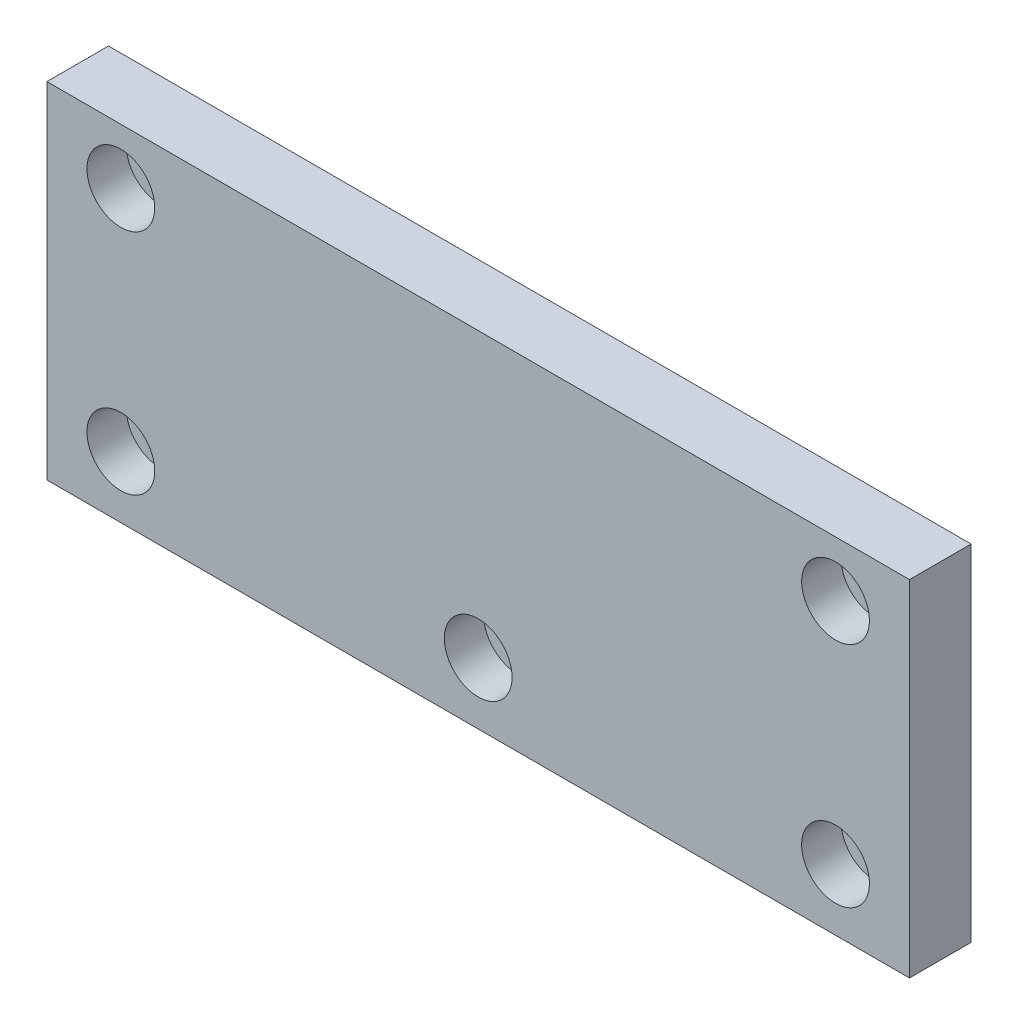
ISO-10303-21;
HEADER;
FILE_DESCRIPTION(('STEP AP214'),'2;1');
FILE_NAME('part.step','',(''),(''),'','','');
FILE_SCHEMA(('AUTOMOTIVE_DESIGN { 1 0 10303 214 1 1 1 1 }'));
ENDSEC;
DATA;
#1=APPLICATION_CONTEXT('core data for automotive mechanical design processes');
#2=APPLICATION_PROTOCOL_DEFINITION('international standard','automotive_design',2000,#1);
#3=PRODUCT_CONTEXT('',#1,'mechanical');
#4=PRODUCT('Part','Part','',(#3));
#5=PRODUCT_RELATED_PRODUCT_CATEGORY('part','',(#4));
#6=PRODUCT_DEFINITION_FORMATION('','',#4);
#7=PRODUCT_DEFINITION_CONTEXT('part definition',#1,'design');
#8=PRODUCT_DEFINITION('design','',#6,#7);
#9=PRODUCT_DEFINITION_SHAPE('','',#8);
#10=(LENGTH_UNIT() NAMED_UNIT(*) SI_UNIT(.MILLI.,.METRE.));
#11=(NAMED_UNIT(*) PLANE_ANGLE_UNIT() SI_UNIT($,.RADIAN.));
#12=(NAMED_UNIT(*) SI_UNIT($,.STERADIAN.) SOLID_ANGLE_UNIT());
#13=UNCERTAINTY_MEASURE_WITH_UNIT(LENGTH_MEASURE(1.E-05),#10,'distance_accuracy_value','');
#14=(GEOMETRIC_REPRESENTATION_CONTEXT(3) GLOBAL_UNCERTAINTY_ASSIGNED_CONTEXT((#13)) GLOBAL_UNIT_ASSIGNED_CONTEXT((#10,
#11,#12)) REPRESENTATION_CONTEXT('',''));
#15=CARTESIAN_POINT('',(0.,0.,0.));
#16=DIRECTION('',(0.,0.,1.));
#17=DIRECTION('',(1.,0.,0.));
#18=AXIS2_PLACEMENT_3D('',#15,#16,#17);
#19=CARTESIAN_POINT('',(70.,28.,10.));
#20=DIRECTION('',(-1.,0.,0.));
#21=DIRECTION('',(0.,-1.,0.));
#22=AXIS2_PLACEMENT_3D('',#19,#20,#21);
#23=PLANE('',#22);
#24=DIRECTION('',(0.,1.,0.));
#25=VECTOR('',#24,1.);
#26=CARTESIAN_POINT('',(70.,28.,0.));
#27=LINE('',#26,#25);
#28=CARTESIAN_POINT('',(70.,-28.,0.));
#29=VERTEX_POINT('',#28);
#30=CARTESIAN_POINT('',(70.,28.,0.));
#31=VERTEX_POINT('',#30);
#32=EDGE_CURVE('E100',#29,#31,#27,.T.);
#33=ORIENTED_EDGE('',*,*,#32,.T.);
#34=DIRECTION('',(0.,0.,-1.));
#35=VECTOR('',#34,1.);
#36=CARTESIAN_POINT('',(70.,28.,10.));
#37=LINE('',#36,#35);
#38=CARTESIAN_POINT('',(70.,28.,10.));
#39=VERTEX_POINT('',#38);
#40=EDGE_CURVE('E11',#39,#31,#37,.T.);
#41=ORIENTED_EDGE('',*,*,#40,.F.);
#42=DIRECTION('',(0.,1.,0.));
#43=VECTOR('',#42,1.);
#44=CARTESIAN_POINT('',(70.,28.,10.));
#45=LINE('',#44,#43);
#46=CARTESIAN_POINT('',(70.,-28.,10.));
#47=VERTEX_POINT('',#46);
#48=EDGE_CURVE('E88',#47,#39,#45,.T.);
#49=ORIENTED_EDGE('',*,*,#48,.F.);
#50=DIRECTION('',(0.,0.,-1.));
#51=VECTOR('',#50,1.);
#52=CARTESIAN_POINT('',(70.,-28.,10.));
#53=LINE('',#52,#51);
#54=EDGE_CURVE('E96',#47,#29,#53,.T.);
#55=ORIENTED_EDGE('',*,*,#54,.T.);
#56=EDGE_LOOP('',(#33,#41,#49,#55));
#57=FACE_BOUND('',#56,.T.);
#58=ADVANCED_FACE('F37',(#57),#23,.F.);
#59=CARTESIAN_POINT('',(-70.,28.,10.));
#60=DIRECTION('',(0.,-1.,0.));
#61=DIRECTION('',(1.,0.,0.));
#62=AXIS2_PLACEMENT_3D('',#59,#60,#61);
#63=PLANE('',#62);
#64=DIRECTION('',(-1.,0.,0.));
#65=VECTOR('',#64,1.);
#66=CARTESIAN_POINT('',(-70.,28.,0.));
#67=LINE('',#66,#65);
#68=CARTESIAN_POINT('',(-70.,28.,0.));
#69=VERTEX_POINT('',#68);
#70=EDGE_CURVE('E92',#31,#69,#67,.T.);
#71=ORIENTED_EDGE('',*,*,#70,.T.);
#72=DIRECTION('',(0.,0.,-1.));
#73=VECTOR('',#72,1.);
#74=CARTESIAN_POINT('',(-70.,28.,10.));
#75=LINE('',#74,#73);
#76=CARTESIAN_POINT('',(-70.,28.,10.));
#77=VERTEX_POINT('',#76);
#78=EDGE_CURVE('E45',#77,#69,#75,.T.);
#79=ORIENTED_EDGE('',*,*,#78,.F.);
#80=DIRECTION('',(-1.,0.,0.));
#81=VECTOR('',#80,1.);
#82=CARTESIAN_POINT('',(-70.,28.,10.));
#83=LINE('',#82,#81);
#84=EDGE_CURVE('E83',#39,#77,#83,.T.);
#85=ORIENTED_EDGE('',*,*,#84,.F.);
#86=ORIENTED_EDGE('',*,*,#40,.T.);
#87=EDGE_LOOP('',(#71,#79,#85,#86));
#88=FACE_BOUND('',#87,.T.);
#89=ADVANCED_FACE('F91',(#88),#63,.F.);
#90=CARTESIAN_POINT('',(-70.,28.,10.));
#91=DIRECTION('',(1.,0.,0.));
#92=DIRECTION('',(0.,1.,0.));
#93=AXIS2_PLACEMENT_3D('',#90,#91,#92);
#94=PLANE('',#93);
#95=DIRECTION('',(0.,-1.,0.));
#96=VECTOR('',#95,1.);
#97=CARTESIAN_POINT('',(-70.,28.,0.));
#98=LINE('',#97,#96);
#99=CARTESIAN_POINT('',(-70.,-28.,0.));
#100=VERTEX_POINT('',#99);
#101=EDGE_CURVE('E70',#69,#100,#98,.T.);
#102=ORIENTED_EDGE('',*,*,#101,.T.);
#103=DIRECTION('',(0.,0.,-1.));
#104=VECTOR('',#103,1.);
#105=CARTESIAN_POINT('',(-70.,-28.,10.));
#106=LINE('',#105,#104);
#107=CARTESIAN_POINT('',(-70.,-28.,10.));
#108=VERTEX_POINT('',#107);
#109=EDGE_CURVE('E93',#108,#100,#106,.T.);
#110=ORIENTED_EDGE('',*,*,#109,.F.);
#111=DIRECTION('',(0.,-1.,0.));
#112=VECTOR('',#111,1.);
#113=CARTESIAN_POINT('',(-70.,28.,10.));
#114=LINE('',#113,#112);
#115=EDGE_CURVE('E86',#77,#108,#114,.T.);
#116=ORIENTED_EDGE('',*,*,#115,.F.);
#117=ORIENTED_EDGE('',*,*,#78,.T.);
#118=EDGE_LOOP('',(#102,#110,#116,#117));
#119=FACE_BOUND('',#118,.T.);
#120=ADVANCED_FACE('F94',(#119),#94,.F.);
#121=CARTESIAN_POINT('',(-70.,-28.,10.));
#122=DIRECTION('',(0.,1.,0.));
#123=DIRECTION('',(-1.,0.,0.));
#124=AXIS2_PLACEMENT_3D('',#121,#122,#123);
#125=PLANE('',#124);
#126=DIRECTION('',(1.,0.,0.));
#127=VECTOR('',#126,1.);
#128=CARTESIAN_POINT('',(-70.,-28.,0.));
#129=LINE('',#128,#127);
#130=EDGE_CURVE('E76',#100,#29,#129,.T.);
#131=ORIENTED_EDGE('',*,*,#130,.T.);
#132=ORIENTED_EDGE('',*,*,#54,.F.);
#133=DIRECTION('',(1.,0.,0.));
#134=VECTOR('',#133,1.);
#135=CARTESIAN_POINT('',(-70.,-28.,10.));
#136=LINE('',#135,#134);
#137=EDGE_CURVE('E53',#108,#47,#136,.T.);
#138=ORIENTED_EDGE('',*,*,#137,.F.);
#139=ORIENTED_EDGE('',*,*,#109,.T.);
#140=EDGE_LOOP('',(#131,#132,#138,#139));
#141=FACE_BOUND('',#140,.T.);
#142=ADVANCED_FACE('F108',(#141),#125,.F.);
#143=CARTESIAN_POINT('',(0.,0.,10.));
#144=DIRECTION('',(0.,0.,1.));
#145=DIRECTION('',(1.,0.,0.));
#146=AXIS2_PLACEMENT_3D('',#143,#144,#145);
#147=PLANE('',#146);
#148=CARTESIAN_POINT('',(58.0000000000009,-17.9999999999985,10.));
#149=DIRECTION('',(0.,0.,1.));
#150=DIRECTION('',(1.,0.,0.));
#151=AXIS2_PLACEMENT_3D('',#148,#149,#150);
#152=CIRCLE('',#151,5.49999999999999);
#153=CARTESIAN_POINT('',(63.5000000000009,-17.9999999999985,10.));
#154=VERTEX_POINT('',#153);
#155=EDGE_CURVE('E170',#154,#154,#152,.T.);
#156=ORIENTED_EDGE('',*,*,#155,.F.);
#157=EDGE_LOOP('',(#156));
#158=FACE_BOUND('',#157,.T.);
#159=CARTESIAN_POINT('',(58.0000000000009,19.0000000000015,10.));
#160=DIRECTION('',(0.,0.,1.));
#161=DIRECTION('',(1.,0.,0.));
#162=AXIS2_PLACEMENT_3D('',#159,#160,#161);
#163=CIRCLE('',#162,5.49999999999999);
#164=CARTESIAN_POINT('',(63.5000000000009,19.0000000000015,10.));
#165=VERTEX_POINT('',#164);
#166=EDGE_CURVE('E158',#165,#165,#163,.T.);
#167=ORIENTED_EDGE('',*,*,#166,.F.);
#168=EDGE_LOOP('',(#167));
#169=FACE_BOUND('',#168,.T.);
#170=CARTESIAN_POINT('',(8.88178419700125E-13,-17.9999999999985,10.));
#171=DIRECTION('',(0.,0.,1.));
#172=DIRECTION('',(1.,0.,0.));
#173=AXIS2_PLACEMENT_3D('',#170,#171,#172);
#174=CIRCLE('',#173,5.49999999999999);
#175=CARTESIAN_POINT('',(5.50000000000088,-17.9999999999985,10.));
#176=VERTEX_POINT('',#175);
#177=EDGE_CURVE('E146',#176,#176,#174,.T.);
#178=ORIENTED_EDGE('',*,*,#177,.F.);
#179=EDGE_LOOP('',(#178));
#180=FACE_BOUND('',#179,.T.);
#181=CARTESIAN_POINT('',(-57.9999999999991,-17.9999999999985,10.));
#182=DIRECTION('',(0.,0.,1.));
#183=DIRECTION('',(1.,0.,0.));
#184=AXIS2_PLACEMENT_3D('',#181,#182,#183);
#185=CIRCLE('',#184,5.49999999999999);
#186=CARTESIAN_POINT('',(-52.4999999999991,-17.9999999999985,10.));
#187=VERTEX_POINT('',#186);
#188=EDGE_CURVE('E134',#187,#187,#185,.T.);
#189=ORIENTED_EDGE('',*,*,#188,.F.);
#190=EDGE_LOOP('',(#189));
#191=FACE_BOUND('',#190,.T.);
#192=CARTESIAN_POINT('',(-57.9999999999991,19.0000000000015,10.));
#193=DIRECTION('',(0.,0.,1.));
#194=DIRECTION('',(1.,0.,0.));
#195=AXIS2_PLACEMENT_3D('',#192,#193,#194);
#196=CIRCLE('',#195,5.49999999999999);
#197=CARTESIAN_POINT('',(-52.4999999999991,19.0000000000015,10.));
#198=VERTEX_POINT('',#197);
#199=EDGE_CURVE('E122',#198,#198,#196,.T.);
#200=ORIENTED_EDGE('',*,*,#199,.F.);
#201=EDGE_LOOP('',(#200));
#202=FACE_BOUND('',#201,.T.);
#203=ORIENTED_EDGE('',*,*,#48,.T.);
#204=ORIENTED_EDGE('',*,*,#84,.T.);
#205=ORIENTED_EDGE('',*,*,#115,.T.);
#206=ORIENTED_EDGE('',*,*,#137,.T.);
#207=EDGE_LOOP('',(#203,#204,#205,#206));
#208=FACE_BOUND('',#207,.T.);
#209=ADVANCED_FACE('F84',(#158,#169,#180,#191,#202,#208),#147,.T.);
#210=CARTESIAN_POINT('',(0.,0.,0.));
#211=DIRECTION('',(0.,0.,1.));
#212=DIRECTION('',(1.,0.,0.));
#213=AXIS2_PLACEMENT_3D('',#210,#211,#212);
#214=PLANE('',#213);
#215=CARTESIAN_POINT('',(58.0000000000009,-17.9999999999985,0.));
#216=DIRECTION('',(0.,0.,1.));
#217=DIRECTION('',(1.,0.,0.));
#218=AXIS2_PLACEMENT_3D('',#215,#216,#217);
#219=CIRCLE('',#218,3.3);
#220=CARTESIAN_POINT('',(61.3000000000009,-17.9999999999985,0.));
#221=VERTEX_POINT('',#220);
#222=EDGE_CURVE('E161',#221,#221,#219,.T.);
#223=ORIENTED_EDGE('',*,*,#222,.T.);
#224=EDGE_LOOP('',(#223));
#225=FACE_BOUND('',#224,.T.);
#226=CARTESIAN_POINT('',(58.0000000000009,19.0000000000015,0.));
#227=DIRECTION('',(0.,0.,1.));
#228=DIRECTION('',(1.,0.,0.));
#229=AXIS2_PLACEMENT_3D('',#226,#227,#228);
#230=CIRCLE('',#229,3.3);
#231=CARTESIAN_POINT('',(61.3000000000009,19.0000000000015,0.));
#232=VERTEX_POINT('',#231);
#233=EDGE_CURVE('E149',#232,#232,#230,.T.);
#234=ORIENTED_EDGE('',*,*,#233,.T.);
#235=EDGE_LOOP('',(#234));
#236=FACE_BOUND('',#235,.T.);
#237=CARTESIAN_POINT('',(8.88178419700125E-13,-17.9999999999985,0.));
#238=DIRECTION('',(0.,0.,1.));
#239=DIRECTION('',(1.,0.,0.));
#240=AXIS2_PLACEMENT_3D('',#237,#238,#239);
#241=CIRCLE('',#240,3.3);
#242=CARTESIAN_POINT('',(3.30000000000089,-17.9999999999985,0.));
#243=VERTEX_POINT('',#242);
#244=EDGE_CURVE('E137',#243,#243,#241,.T.);
#245=ORIENTED_EDGE('',*,*,#244,.T.);
#246=EDGE_LOOP('',(#245));
#247=FACE_BOUND('',#246,.T.);
#248=CARTESIAN_POINT('',(-57.9999999999991,-17.9999999999985,0.));
#249=DIRECTION('',(0.,0.,1.));
#250=DIRECTION('',(1.,0.,0.));
#251=AXIS2_PLACEMENT_3D('',#248,#249,#250);
#252=CIRCLE('',#251,3.3);
#253=CARTESIAN_POINT('',(-54.6999999999991,-17.9999999999985,0.));
#254=VERTEX_POINT('',#253);
#255=EDGE_CURVE('E125',#254,#254,#252,.T.);
#256=ORIENTED_EDGE('',*,*,#255,.T.);
#257=EDGE_LOOP('',(#256));
#258=FACE_BOUND('',#257,.T.);
#259=CARTESIAN_POINT('',(-57.9999999999991,19.0000000000015,0.));
#260=DIRECTION('',(0.,0.,1.));
#261=DIRECTION('',(1.,0.,0.));
#262=AXIS2_PLACEMENT_3D('',#259,#260,#261);
#263=CIRCLE('',#262,3.3);
#264=CARTESIAN_POINT('',(-54.6999999999991,19.0000000000015,0.));
#265=VERTEX_POINT('',#264);
#266=EDGE_CURVE('E103',#265,#265,#263,.T.);
#267=ORIENTED_EDGE('',*,*,#266,.T.);
#268=EDGE_LOOP('',(#267));
#269=FACE_BOUND('',#268,.T.);
#270=ORIENTED_EDGE('',*,*,#32,.F.);
#271=ORIENTED_EDGE('',*,*,#130,.F.);
#272=ORIENTED_EDGE('',*,*,#101,.F.);
#273=ORIENTED_EDGE('',*,*,#70,.F.);
#274=EDGE_LOOP('',(#270,#271,#272,#273));
#275=FACE_BOUND('',#274,.T.);
#276=ADVANCED_FACE('F111',(#225,#236,#247,#258,#269,#275),#214,.F.);
#277=CARTESIAN_POINT('',(-57.9999999999991,19.0000000000015,10.));
#278=DIRECTION('',(0.,0.,1.));
#279=DIRECTION('',(1.,0.,0.));
#280=AXIS2_PLACEMENT_3D('',#277,#278,#279);
#281=CYLINDRICAL_SURFACE('',#280,3.3);
#282=ORIENTED_EDGE('',*,*,#266,.F.);
#283=EDGE_LOOP('',(#282));
#284=FACE_BOUND('',#283,.T.);
#285=CARTESIAN_POINT('',(-57.9999999999991,19.0000000000015,3.6));
#286=DIRECTION('',(0.,0.,1.));
#287=DIRECTION('',(1.,0.,0.));
#288=AXIS2_PLACEMENT_3D('',#285,#286,#287);
#289=CIRCLE('',#288,3.30000000000001);
#290=CARTESIAN_POINT('',(-54.6999999999991,19.0000000000015,3.6));
#291=VERTEX_POINT('',#290);
#292=EDGE_CURVE('E116',#291,#291,#289,.T.);
#293=ORIENTED_EDGE('',*,*,#292,.T.);
#294=EDGE_LOOP('',(#293));
#295=FACE_BOUND('',#294,.T.);
#296=ADVANCED_FACE('F200',(#284,#295),#281,.F.);
#297=CARTESIAN_POINT('',(-54.6999999999991,19.0000000000015,3.6));
#298=DIRECTION('',(0.,0.,-1.));
#299=DIRECTION('',(-1.,0.,0.));
#300=AXIS2_PLACEMENT_3D('',#297,#298,#299);
#301=PLANE('',#300);
#302=ORIENTED_EDGE('',*,*,#292,.F.);
#303=EDGE_LOOP('',(#302));
#304=FACE_BOUND('',#303,.T.);
#305=CARTESIAN_POINT('',(-57.9999999999991,19.0000000000015,3.6));
#306=DIRECTION('',(0.,0.,1.));
#307=DIRECTION('',(1.,0.,0.));
#308=AXIS2_PLACEMENT_3D('',#305,#306,#307);
#309=CIRCLE('',#308,5.49999999999999);
#310=CARTESIAN_POINT('',(-52.4999999999991,19.0000000000015,3.6));
#311=VERTEX_POINT('',#310);
#312=EDGE_CURVE('E119',#311,#311,#309,.T.);
#313=ORIENTED_EDGE('',*,*,#312,.T.);
#314=EDGE_LOOP('',(#313));
#315=FACE_BOUND('',#314,.T.);
#316=ADVANCED_FACE('F190',(#304,#315),#301,.F.);
#317=CARTESIAN_POINT('',(-57.9999999999991,19.0000000000015,10.));
#318=DIRECTION('',(0.,0.,1.));
#319=DIRECTION('',(1.,0.,0.));
#320=AXIS2_PLACEMENT_3D('',#317,#318,#319);
#321=CYLINDRICAL_SURFACE('',#320,5.49999999999999);
#322=ORIENTED_EDGE('',*,*,#312,.F.);
#323=EDGE_LOOP('',(#322));
#324=FACE_BOUND('',#323,.T.);
#325=ORIENTED_EDGE('',*,*,#199,.T.);
#326=EDGE_LOOP('',(#325));
#327=FACE_BOUND('',#326,.T.);
#328=ADVANCED_FACE('F187',(#324,#327),#321,.F.);
#329=CARTESIAN_POINT('',(-57.9999999999991,-17.9999999999985,10.));
#330=DIRECTION('',(0.,0.,1.));
#331=DIRECTION('',(1.,0.,0.));
#332=AXIS2_PLACEMENT_3D('',#329,#330,#331);
#333=CYLINDRICAL_SURFACE('',#332,3.3);
#334=ORIENTED_EDGE('',*,*,#255,.F.);
#335=EDGE_LOOP('',(#334));
#336=FACE_BOUND('',#335,.T.);
#337=CARTESIAN_POINT('',(-57.9999999999991,-17.9999999999985,3.6));
#338=DIRECTION('',(0.,0.,1.));
#339=DIRECTION('',(1.,0.,0.));
#340=AXIS2_PLACEMENT_3D('',#337,#338,#339);
#341=CIRCLE('',#340,3.30000000000001);
#342=CARTESIAN_POINT('',(-54.6999999999991,-17.9999999999985,3.6));
#343=VERTEX_POINT('',#342);
#344=EDGE_CURVE('E128',#343,#343,#341,.T.);
#345=ORIENTED_EDGE('',*,*,#344,.T.);
#346=EDGE_LOOP('',(#345));
#347=FACE_BOUND('',#346,.T.);
#348=ADVANCED_FACE('F189',(#336,#347),#333,.F.);
#349=CARTESIAN_POINT('',(-54.6999999999991,-17.9999999999985,3.6));
#350=DIRECTION('',(0.,0.,-1.));
#351=DIRECTION('',(-1.,0.,0.));
#352=AXIS2_PLACEMENT_3D('',#349,#350,#351);
#353=PLANE('',#352);
#354=ORIENTED_EDGE('',*,*,#344,.F.);
#355=EDGE_LOOP('',(#354));
#356=FACE_BOUND('',#355,.T.);
#357=CARTESIAN_POINT('',(-57.9999999999991,-17.9999999999985,3.6));
#358=DIRECTION('',(0.,0.,1.));
#359=DIRECTION('',(1.,0.,0.));
#360=AXIS2_PLACEMENT_3D('',#357,#358,#359);
#361=CIRCLE('',#360,5.49999999999999);
#362=CARTESIAN_POINT('',(-52.4999999999991,-17.9999999999985,3.6));
#363=VERTEX_POINT('',#362);
#364=EDGE_CURVE('E131',#363,#363,#361,.T.);
#365=ORIENTED_EDGE('',*,*,#364,.T.);
#366=EDGE_LOOP('',(#365));
#367=FACE_BOUND('',#366,.T.);
#368=ADVANCED_FACE('F197',(#356,#367),#353,.F.);
#369=CARTESIAN_POINT('',(-57.9999999999991,-17.9999999999985,10.));
#370=DIRECTION('',(0.,0.,1.));
#371=DIRECTION('',(1.,0.,0.));
#372=AXIS2_PLACEMENT_3D('',#369,#370,#371);
#373=CYLINDRICAL_SURFACE('',#372,5.49999999999999);
#374=ORIENTED_EDGE('',*,*,#364,.F.);
#375=EDGE_LOOP('',(#374));
#376=FACE_BOUND('',#375,.T.);
#377=ORIENTED_EDGE('',*,*,#188,.T.);
#378=EDGE_LOOP('',(#377));
#379=FACE_BOUND('',#378,.T.);
#380=ADVANCED_FACE('F252',(#376,#379),#373,.F.);
#381=CARTESIAN_POINT('',(8.88178419700125E-13,-17.9999999999985,10.));
#382=DIRECTION('',(0.,0.,1.));
#383=DIRECTION('',(1.,0.,0.));
#384=AXIS2_PLACEMENT_3D('',#381,#382,#383);
#385=CYLINDRICAL_SURFACE('',#384,3.30000000000001);
#386=ORIENTED_EDGE('',*,*,#244,.F.);
#387=EDGE_LOOP('',(#386));
#388=FACE_BOUND('',#387,.T.);
#389=CARTESIAN_POINT('',(8.88178419700125E-13,-17.9999999999985,3.6));
#390=DIRECTION('',(0.,0.,1.));
#391=DIRECTION('',(1.,0.,0.));
#392=AXIS2_PLACEMENT_3D('',#389,#390,#391);
#393=CIRCLE('',#392,3.30000000000001);
#394=CARTESIAN_POINT('',(3.3000000000009,-17.9999999999985,3.6));
#395=VERTEX_POINT('',#394);
#396=EDGE_CURVE('E140',#395,#395,#393,.T.);
#397=ORIENTED_EDGE('',*,*,#396,.T.);
#398=EDGE_LOOP('',(#397));
#399=FACE_BOUND('',#398,.T.);
#400=ADVANCED_FACE('F262',(#388,#399),#385,.F.);
#401=CARTESIAN_POINT('',(3.3000000000009,-17.9999999999985,3.6));
#402=DIRECTION('',(0.,0.,-1.));
#403=DIRECTION('',(-1.,0.,0.));
#404=AXIS2_PLACEMENT_3D('',#401,#402,#403);
#405=PLANE('',#404);
#406=ORIENTED_EDGE('',*,*,#396,.F.);
#407=EDGE_LOOP('',(#406));
#408=FACE_BOUND('',#407,.T.);
#409=CARTESIAN_POINT('',(8.88178419700125E-13,-17.9999999999985,3.6));
#410=DIRECTION('',(0.,0.,1.));
#411=DIRECTION('',(1.,0.,0.));
#412=AXIS2_PLACEMENT_3D('',#409,#410,#411);
#413=CIRCLE('',#412,5.49999999999999);
#414=CARTESIAN_POINT('',(5.50000000000088,-17.9999999999985,3.6));
#415=VERTEX_POINT('',#414);
#416=EDGE_CURVE('E143',#415,#415,#413,.T.);
#417=ORIENTED_EDGE('',*,*,#416,.T.);
#418=EDGE_LOOP('',(#417));
#419=FACE_BOUND('',#418,.T.);
#420=ADVANCED_FACE('F272',(#408,#419),#405,.F.);
#421=CARTESIAN_POINT('',(8.88178419700125E-13,-17.9999999999985,10.));
#422=DIRECTION('',(0.,0.,1.));
#423=DIRECTION('',(1.,0.,0.));
#424=AXIS2_PLACEMENT_3D('',#421,#422,#423);
#425=CYLINDRICAL_SURFACE('',#424,5.49999999999999);
#426=ORIENTED_EDGE('',*,*,#416,.F.);
#427=EDGE_LOOP('',(#426));
#428=FACE_BOUND('',#427,.T.);
#429=ORIENTED_EDGE('',*,*,#177,.T.);
#430=EDGE_LOOP('',(#429));
#431=FACE_BOUND('',#430,.T.);
#432=ADVANCED_FACE('F282',(#428,#431),#425,.F.);
#433=CARTESIAN_POINT('',(58.0000000000009,19.0000000000015,10.));
#434=DIRECTION('',(0.,0.,1.));
#435=DIRECTION('',(1.,0.,0.));
#436=AXIS2_PLACEMENT_3D('',#433,#434,#435);
#437=CYLINDRICAL_SURFACE('',#436,3.3);
#438=ORIENTED_EDGE('',*,*,#233,.F.);
#439=EDGE_LOOP('',(#438));
#440=FACE_BOUND('',#439,.T.);
#441=CARTESIAN_POINT('',(58.0000000000009,19.0000000000015,3.6));
#442=DIRECTION('',(0.,0.,1.));
#443=DIRECTION('',(1.,0.,0.));
#444=AXIS2_PLACEMENT_3D('',#441,#442,#443);
#445=CIRCLE('',#444,3.30000000000001);
#446=CARTESIAN_POINT('',(61.3000000000009,19.0000000000015,3.6));
#447=VERTEX_POINT('',#446);
#448=EDGE_CURVE('E152',#447,#447,#445,.T.);
#449=ORIENTED_EDGE('',*,*,#448,.T.);
#450=EDGE_LOOP('',(#449));
#451=FACE_BOUND('',#450,.T.);
#452=ADVANCED_FACE('F292',(#440,#451),#437,.F.);
#453=CARTESIAN_POINT('',(61.3000000000009,19.0000000000015,3.6));
#454=DIRECTION('',(0.,0.,-1.));
#455=DIRECTION('',(-1.,0.,0.));
#456=AXIS2_PLACEMENT_3D('',#453,#454,#455);
#457=PLANE('',#456);
#458=ORIENTED_EDGE('',*,*,#448,.F.);
#459=EDGE_LOOP('',(#458));
#460=FACE_BOUND('',#459,.T.);
#461=CARTESIAN_POINT('',(58.0000000000009,19.0000000000015,3.6));
#462=DIRECTION('',(0.,0.,1.));
#463=DIRECTION('',(1.,0.,0.));
#464=AXIS2_PLACEMENT_3D('',#461,#462,#463);
#465=CIRCLE('',#464,5.49999999999999);
#466=CARTESIAN_POINT('',(63.5000000000009,19.0000000000015,3.6));
#467=VERTEX_POINT('',#466);
#468=EDGE_CURVE('E155',#467,#467,#465,.T.);
#469=ORIENTED_EDGE('',*,*,#468,.T.);
#470=EDGE_LOOP('',(#469));
#471=FACE_BOUND('',#470,.T.);
#472=ADVANCED_FACE('F302',(#460,#471),#457,.F.);
#473=CARTESIAN_POINT('',(58.0000000000009,19.0000000000015,10.));
#474=DIRECTION('',(0.,0.,1.));
#475=DIRECTION('',(1.,0.,0.));
#476=AXIS2_PLACEMENT_3D('',#473,#474,#475);
#477=CYLINDRICAL_SURFACE('',#476,5.49999999999999);
#478=ORIENTED_EDGE('',*,*,#468,.F.);
#479=EDGE_LOOP('',(#478));
#480=FACE_BOUND('',#479,.T.);
#481=ORIENTED_EDGE('',*,*,#166,.T.);
#482=EDGE_LOOP('',(#481));
#483=FACE_BOUND('',#482,.T.);
#484=ADVANCED_FACE('F312',(#480,#483),#477,.F.);
#485=CARTESIAN_POINT('',(58.0000000000009,-17.9999999999985,10.));
#486=DIRECTION('',(0.,0.,1.));
#487=DIRECTION('',(1.,0.,0.));
#488=AXIS2_PLACEMENT_3D('',#485,#486,#487);
#489=CYLINDRICAL_SURFACE('',#488,3.3);
#490=ORIENTED_EDGE('',*,*,#222,.F.);
#491=EDGE_LOOP('',(#490));
#492=FACE_BOUND('',#491,.T.);
#493=CARTESIAN_POINT('',(58.0000000000009,-17.9999999999985,3.6));
#494=DIRECTION('',(0.,0.,1.));
#495=DIRECTION('',(1.,0.,0.));
#496=AXIS2_PLACEMENT_3D('',#493,#494,#495);
#497=CIRCLE('',#496,3.30000000000001);
#498=CARTESIAN_POINT('',(61.3000000000009,-17.9999999999985,3.6));
#499=VERTEX_POINT('',#498);
#500=EDGE_CURVE('E164',#499,#499,#497,.T.);
#501=ORIENTED_EDGE('',*,*,#500,.T.);
#502=EDGE_LOOP('',(#501));
#503=FACE_BOUND('',#502,.T.);
#504=ADVANCED_FACE('F322',(#492,#503),#489,.F.);
#505=CARTESIAN_POINT('',(61.3000000000009,-17.9999999999985,3.6));
#506=DIRECTION('',(0.,0.,-1.));
#507=DIRECTION('',(-1.,0.,0.));
#508=AXIS2_PLACEMENT_3D('',#505,#506,#507);
#509=PLANE('',#508);
#510=ORIENTED_EDGE('',*,*,#500,.F.);
#511=EDGE_LOOP('',(#510));
#512=FACE_BOUND('',#511,.T.);
#513=CARTESIAN_POINT('',(58.0000000000009,-17.9999999999985,3.6));
#514=DIRECTION('',(0.,0.,1.));
#515=DIRECTION('',(1.,0.,0.));
#516=AXIS2_PLACEMENT_3D('',#513,#514,#515);
#517=CIRCLE('',#516,5.49999999999999);
#518=CARTESIAN_POINT('',(63.5000000000009,-17.9999999999985,3.6));
#519=VERTEX_POINT('',#518);
#520=EDGE_CURVE('E167',#519,#519,#517,.T.);
#521=ORIENTED_EDGE('',*,*,#520,.T.);
#522=EDGE_LOOP('',(#521));
#523=FACE_BOUND('',#522,.T.);
#524=ADVANCED_FACE('F332',(#512,#523),#509,.F.);
#525=CARTESIAN_POINT('',(58.0000000000009,-17.9999999999985,10.));
#526=DIRECTION('',(0.,0.,1.));
#527=DIRECTION('',(1.,0.,0.));
#528=AXIS2_PLACEMENT_3D('',#525,#526,#527);
#529=CYLINDRICAL_SURFACE('',#528,5.49999999999999);
#530=ORIENTED_EDGE('',*,*,#520,.F.);
#531=EDGE_LOOP('',(#530));
#532=FACE_BOUND('',#531,.T.);
#533=ORIENTED_EDGE('',*,*,#155,.T.);
#534=EDGE_LOOP('',(#533));
#535=FACE_BOUND('',#534,.T.);
#536=ADVANCED_FACE('F174',(#532,#535),#529,.F.);
#537=CLOSED_SHELL('',(#58,#89,#120,#142,#209,#276,#296,#316,#328,#348,#368,#380,#400,#420,#432,
#452,#472,#484,#504,#524,#536));
#538=MANIFOLD_SOLID_BREP('B2',#537);
#539=ADVANCED_BREP_SHAPE_REPRESENTATION('',(#18,#538),#14);
#540=SHAPE_DEFINITION_REPRESENTATION(#9,#539);
ENDSEC;
END-ISO-10303-21;
